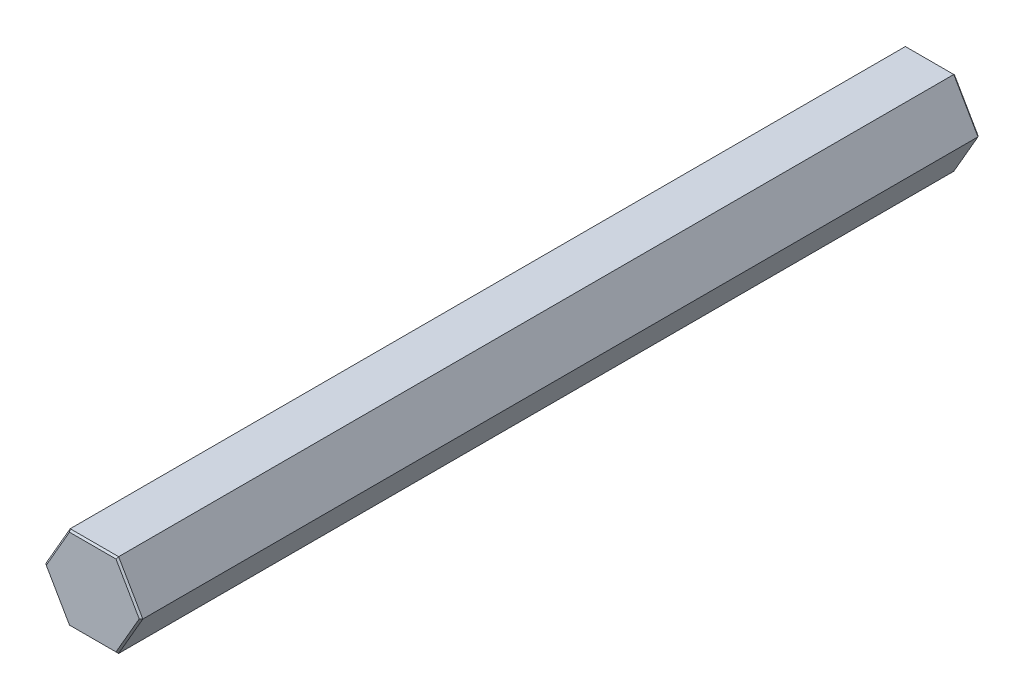
ISO-10303-21;
HEADER;
FILE_DESCRIPTION(('STEP AP214'),'2;1');
FILE_NAME('part.step','',(''),(''),'','','');
FILE_SCHEMA(('AUTOMOTIVE_DESIGN { 1 0 10303 214 1 1 1 1 }'));
ENDSEC;
DATA;
#1=APPLICATION_CONTEXT('core data for automotive mechanical design processes');
#2=APPLICATION_PROTOCOL_DEFINITION('international standard','automotive_design',2000,#1);
#3=PRODUCT_CONTEXT('',#1,'mechanical');
#4=PRODUCT('Part','Part','',(#3));
#5=PRODUCT_RELATED_PRODUCT_CATEGORY('part','',(#4));
#6=PRODUCT_DEFINITION_FORMATION('','',#4);
#7=PRODUCT_DEFINITION_CONTEXT('part definition',#1,'design');
#8=PRODUCT_DEFINITION('design','',#6,#7);
#9=PRODUCT_DEFINITION_SHAPE('','',#8);
#10=(LENGTH_UNIT() NAMED_UNIT(*) SI_UNIT(.MILLI.,.METRE.));
#11=(NAMED_UNIT(*) PLANE_ANGLE_UNIT() SI_UNIT($,.RADIAN.));
#12=(NAMED_UNIT(*) SI_UNIT($,.STERADIAN.) SOLID_ANGLE_UNIT());
#13=UNCERTAINTY_MEASURE_WITH_UNIT(LENGTH_MEASURE(1.E-05),#10,'distance_accuracy_value','');
#14=(GEOMETRIC_REPRESENTATION_CONTEXT(3) GLOBAL_UNCERTAINTY_ASSIGNED_CONTEXT((#13)) GLOBAL_UNIT_ASSIGNED_CONTEXT((#10,
#11,#12)) REPRESENTATION_CONTEXT('',''));
#15=CARTESIAN_POINT('',(0.,0.,0.));
#16=DIRECTION('',(0.,0.,1.));
#17=DIRECTION('',(1.,0.,0.));
#18=AXIS2_PLACEMENT_3D('',#15,#16,#17);
#19=CARTESIAN_POINT('',(7.11237796614698,-0.12700000000001,127.));
#20=DIRECTION('',(0.612372435695803,0.353553390593279,0.707106781186537));
#21=DIRECTION('',(0.755928946018445,0.,-0.654653670707988));
#22=AXIS2_PLACEMENT_3D('',#19,#20,#21);
#23=PLANE('',#22);
#24=DIRECTION('',(0.755928946018446,0.,-0.654653670707987));
#25=VECTOR('',#24,1.);
#26=CARTESIAN_POINT('',(7.08095361578108,0.,126.963714285714));
#27=LINE('',#26,#25);
#28=CARTESIAN_POINT('',(7.33234841870825,0.,126.746));
#29=VERTEX_POINT('',#28);
#30=CARTESIAN_POINT('',(7.03905448195989,0.,127.));
#31=VERTEX_POINT('',#30);
#32=EDGE_CURVE('E24',#29,#31,#27,.F.);
#33=ORIENTED_EDGE('',*,*,#32,.F.);
#34=DIRECTION('',(0.5,-0.866025403784438,0.));
#35=VECTOR('',#34,1.);
#36=CARTESIAN_POINT('',(7.33234841870825,0.,126.746));
#37=LINE('',#36,#35);
#38=CARTESIAN_POINT('',(3.66617420935412,6.35,126.746));
#39=VERTEX_POINT('',#38);
#40=EDGE_CURVE('E146',#29,#39,#37,.F.);
#41=ORIENTED_EDGE('',*,*,#40,.T.);
#42=DIRECTION('',(0.37796447300922,0.65465367070797,-0.654653670707988));
#43=VECTOR('',#42,1.);
#44=CARTESIAN_POINT('',(3.51952724097994,6.09599999999997,127.));
#45=LINE('',#44,#43);
#46=CARTESIAN_POINT('',(3.51952724097994,6.09599999999997,127.));
#47=VERTEX_POINT('',#46);
#48=EDGE_CURVE('E131',#47,#39,#45,.T.);
#49=ORIENTED_EDGE('',*,*,#48,.F.);
#50=DIRECTION('',(-0.5,0.866025403784438,0.));
#51=VECTOR('',#50,1.);
#52=CARTESIAN_POINT('',(7.03905448195989,0.,127.));
#53=LINE('',#52,#51);
#54=EDGE_CURVE('E108',#31,#47,#53,.T.);
#55=ORIENTED_EDGE('',*,*,#54,.F.);
#56=EDGE_LOOP('',(#33,#41,#49,#55));
#57=FACE_BOUND('',#56,.T.);
#58=ADVANCED_FACE('F21',(#57),#23,.T.);
#59=CARTESIAN_POINT('',(7.11237796614698,0.127000000000015,127.));
#60=DIRECTION('',(0.612372435695802,-0.353553390593278,0.707106781186538));
#61=DIRECTION('',(0.755928946018446,0.,-0.654653670707987));
#62=AXIS2_PLACEMENT_3D('',#59,#60,#61);
#63=PLANE('',#62);
#64=ORIENTED_EDGE('',*,*,#32,.T.);
#65=DIRECTION('',(0.5,0.866025403784439,0.));
#66=VECTOR('',#65,1.);
#67=CARTESIAN_POINT('',(3.51952724097995,-6.09599999999997,127.));
#68=LINE('',#67,#66);
#69=CARTESIAN_POINT('',(3.51952724097994,-6.09599999999997,127.));
#70=VERTEX_POINT('',#69);
#71=EDGE_CURVE('E117',#70,#31,#68,.T.);
#72=ORIENTED_EDGE('',*,*,#71,.F.);
#73=DIRECTION('',(-0.377964473009223,0.654653670707971,0.654653670707986));
#74=VECTOR('',#73,1.);
#75=CARTESIAN_POINT('',(3.66617420935412,-6.35,126.746));
#76=LINE('',#75,#74);
#77=CARTESIAN_POINT('',(3.66617420935412,-6.35,126.746));
#78=VERTEX_POINT('',#77);
#79=EDGE_CURVE('E138',#78,#70,#76,.T.);
#80=ORIENTED_EDGE('',*,*,#79,.F.);
#81=DIRECTION('',(-0.5,-0.866025403784439,0.));
#82=VECTOR('',#81,1.);
#83=CARTESIAN_POINT('',(3.66617420935413,-6.35,126.746));
#84=LINE('',#83,#82);
#85=EDGE_CURVE('E119',#78,#29,#84,.F.);
#86=ORIENTED_EDGE('',*,*,#85,.T.);
#87=EDGE_LOOP('',(#64,#72,#80,#86));
#88=FACE_BOUND('',#87,.T.);
#89=ADVANCED_FACE('F115',(#88),#63,.T.);
#90=CARTESIAN_POINT('',(3.66617420935413,-6.35,0.253999999999976));
#91=DIRECTION('',(-0.612372435695778,0.353553390593264,0.707106781186567));
#92=DIRECTION('',(0.755928946018472,0.,0.654653670707957));
#93=AXIS2_PLACEMENT_3D('',#90,#91,#92);
#94=PLANE('',#93);
#95=DIRECTION('',(0.5,0.866025403784439,0.));
#96=VECTOR('',#95,1.);
#97=CARTESIAN_POINT('',(3.51952724097997,-6.09600000000001,0.));
#98=LINE('',#97,#96);
#99=CARTESIAN_POINT('',(3.51952724097997,-6.09600000000001,0.));
#100=VERTEX_POINT('',#99);
#101=CARTESIAN_POINT('',(7.03905448195993,0.,0.));
#102=VERTEX_POINT('',#101);
#103=EDGE_CURVE('E175',#100,#102,#98,.T.);
#104=ORIENTED_EDGE('',*,*,#103,.T.);
#105=DIRECTION('',(0.755928946018471,0.,0.654653670707958));
#106=VECTOR('',#105,1.);
#107=CARTESIAN_POINT('',(7.33234841870825,0.,0.253999999999976));
#108=LINE('',#107,#106);
#109=CARTESIAN_POINT('',(7.33234841870825,0.,0.253999999999976));
#110=VERTEX_POINT('',#109);
#111=EDGE_CURVE('E124',#102,#110,#108,.T.);
#112=ORIENTED_EDGE('',*,*,#111,.T.);
#113=DIRECTION('',(-0.5,-0.866025403784439,0.));
#114=VECTOR('',#113,1.);
#115=CARTESIAN_POINT('',(3.66617420935413,-6.35,0.253999999999976));
#116=LINE('',#115,#114);
#117=CARTESIAN_POINT('',(3.66617420935413,-6.35,0.253999999999977));
#118=VERTEX_POINT('',#117);
#119=EDGE_CURVE('E190',#110,#118,#116,.T.);
#120=ORIENTED_EDGE('',*,*,#119,.T.);
#121=DIRECTION('',(-0.377964473009233,0.654653670707993,-0.654653670707958));
#122=VECTOR('',#121,1.);
#123=CARTESIAN_POINT('',(3.66617420935413,-6.35,0.253999999999976));
#124=LINE('',#123,#122);
#125=EDGE_CURVE('E208',#118,#100,#124,.T.);
#126=ORIENTED_EDGE('',*,*,#125,.T.);
#127=EDGE_LOOP('',(#104,#112,#120,#126));
#128=FACE_BOUND('',#127,.T.);
#129=ADVANCED_FACE('F188',(#128),#94,.F.);
#130=CARTESIAN_POINT('',(7.33234841870825,0.,0.253999999999976));
#131=DIRECTION('',(-0.612372435695778,-0.353553390593265,0.707106781186566));
#132=DIRECTION('',(0.755928946018471,0.,0.654653670707958));
#133=AXIS2_PLACEMENT_3D('',#130,#131,#132);
#134=PLANE('',#133);
#135=DIRECTION('',(-0.5,0.866025403784438,0.));
#136=VECTOR('',#135,1.);
#137=CARTESIAN_POINT('',(7.03905448195993,0.,0.));
#138=LINE('',#137,#136);
#139=CARTESIAN_POINT('',(3.51952724097996,6.09600000000001,0.));
#140=VERTEX_POINT('',#139);
#141=EDGE_CURVE('E170',#102,#140,#138,.T.);
#142=ORIENTED_EDGE('',*,*,#141,.T.);
#143=DIRECTION('',(0.377964473009235,0.654653670707992,0.654653670707958));
#144=VECTOR('',#143,1.);
#145=CARTESIAN_POINT('',(3.51952724097996,6.09600000000001,0.));
#146=LINE('',#145,#144);
#147=CARTESIAN_POINT('',(3.66617420935412,6.35,0.253999999999977));
#148=VERTEX_POINT('',#147);
#149=EDGE_CURVE('E183',#140,#148,#146,.T.);
#150=ORIENTED_EDGE('',*,*,#149,.T.);
#151=DIRECTION('',(0.5,-0.866025403784438,0.));
#152=VECTOR('',#151,1.);
#153=CARTESIAN_POINT('',(7.33234841870825,0.,0.253999999999976));
#154=LINE('',#153,#152);
#155=EDGE_CURVE('E129',#148,#110,#154,.T.);
#156=ORIENTED_EDGE('',*,*,#155,.T.);
#157=ORIENTED_EDGE('',*,*,#111,.F.);
#158=EDGE_LOOP('',(#142,#150,#156,#157));
#159=FACE_BOUND('',#158,.T.);
#160=ADVANCED_FACE('F196',(#159),#134,.F.);
#161=CARTESIAN_POINT('',(7.33234841870825,6.09599999999997,127.));
#162=DIRECTION('',(0.,0.707106781186557,0.707106781186538));
#163=DIRECTION('',(0.,-0.707106781186538,0.707106781186557));
#164=AXIS2_PLACEMENT_3D('',#161,#162,#163);
#165=PLANE('',#164);
#166=ORIENTED_EDGE('',*,*,#48,.T.);
#167=DIRECTION('',(1.,0.,0.));
#168=VECTOR('',#167,1.);
#169=CARTESIAN_POINT('',(3.66617420935412,6.35,126.746));
#170=LINE('',#169,#168);
#171=CARTESIAN_POINT('',(-3.66617420935412,6.35,126.746));
#172=VERTEX_POINT('',#171);
#173=EDGE_CURVE('E302',#39,#172,#170,.F.);
#174=ORIENTED_EDGE('',*,*,#173,.T.);
#175=DIRECTION('',(-0.377964473009222,0.65465367070797,-0.654653670707988));
#176=VECTOR('',#175,1.);
#177=CARTESIAN_POINT('',(-3.51952724097994,6.09599999999997,127.));
#178=LINE('',#177,#176);
#179=CARTESIAN_POINT('',(-3.51952724097994,6.09599999999997,127.));
#180=VERTEX_POINT('',#179);
#181=EDGE_CURVE('E163',#180,#172,#178,.T.);
#182=ORIENTED_EDGE('',*,*,#181,.F.);
#183=DIRECTION('',(1.,0.,0.));
#184=VECTOR('',#183,1.);
#185=CARTESIAN_POINT('',(7.33234841870825,6.09599999999997,127.));
#186=LINE('',#185,#184);
#187=EDGE_CURVE('E134',#47,#180,#186,.F.);
#188=ORIENTED_EDGE('',*,*,#187,.F.);
#189=EDGE_LOOP('',(#166,#174,#182,#188));
#190=FACE_BOUND('',#189,.T.);
#191=ADVANCED_FACE('F303',(#190),#165,.T.);
#192=CARTESIAN_POINT('',(3.66617420935412,6.35,0.253999999999976));
#193=DIRECTION('',(0.,-0.707106781186529,0.707106781186566));
#194=DIRECTION('',(0.,-0.707106781186566,-0.707106781186529));
#195=AXIS2_PLACEMENT_3D('',#192,#193,#194);
#196=PLANE('',#195);
#197=DIRECTION('',(1.,0.,0.));
#198=VECTOR('',#197,1.);
#199=CARTESIAN_POINT('',(3.66617420935412,6.35,0.253999999999976));
#200=LINE('',#199,#198);
#201=CARTESIAN_POINT('',(-3.66617420935412,6.35,0.253999999999976));
#202=VERTEX_POINT('',#201);
#203=EDGE_CURVE('E306',#202,#148,#200,.T.);
#204=ORIENTED_EDGE('',*,*,#203,.T.);
#205=ORIENTED_EDGE('',*,*,#149,.F.);
#206=DIRECTION('',(1.,0.,0.));
#207=VECTOR('',#206,1.);
#208=CARTESIAN_POINT('',(7.33234841870825,6.09600000000001,0.));
#209=LINE('',#208,#207);
#210=CARTESIAN_POINT('',(-3.51952724097996,6.09600000000001,0.));
#211=VERTEX_POINT('',#210);
#212=EDGE_CURVE('E167',#140,#211,#209,.F.);
#213=ORIENTED_EDGE('',*,*,#212,.T.);
#214=DIRECTION('',(-0.377964473009238,0.654653670707991,0.654653670707957));
#215=VECTOR('',#214,1.);
#216=CARTESIAN_POINT('',(-3.51952724097996,6.09600000000001,0.));
#217=LINE('',#216,#215);
#218=EDGE_CURVE('E307',#211,#202,#217,.T.);
#219=ORIENTED_EDGE('',*,*,#218,.T.);
#220=EDGE_LOOP('',(#204,#205,#213,#219));
#221=FACE_BOUND('',#220,.T.);
#222=ADVANCED_FACE('F316',(#221),#196,.F.);
#223=CARTESIAN_POINT('',(7.33234841870825,0.,127.));
#224=DIRECTION('',(-0.866025403784438,-0.5,0.));
#225=DIRECTION('',(0.5,-0.866025403784438,0.));
#226=AXIS2_PLACEMENT_3D('',#223,#224,#225);
#227=PLANE('',#226);
#228=ORIENTED_EDGE('',*,*,#155,.F.);
#229=DIRECTION('',(0.,0.,-1.));
#230=VECTOR('',#229,1.);
#231=CARTESIAN_POINT('',(3.66617420935412,6.35,127.));
#232=LINE('',#231,#230);
#233=EDGE_CURVE('E312',#148,#39,#232,.F.);
#234=ORIENTED_EDGE('',*,*,#233,.T.);
#235=ORIENTED_EDGE('',*,*,#40,.F.);
#236=DIRECTION('',(0.,0.,1.));
#237=VECTOR('',#236,1.);
#238=CARTESIAN_POINT('',(7.33234841870825,0.,127.));
#239=LINE('',#238,#237);
#240=EDGE_CURVE('E204',#29,#110,#239,.F.);
#241=ORIENTED_EDGE('',*,*,#240,.T.);
#242=EDGE_LOOP('',(#228,#234,#235,#241));
#243=FACE_BOUND('',#242,.T.);
#244=ADVANCED_FACE('F210',(#243),#227,.F.);
#245=CARTESIAN_POINT('',(7.33234841870825,0.,127.));
#246=DIRECTION('',(0.,0.,1.));
#247=DIRECTION('',(1.,0.,0.));
#248=AXIS2_PLACEMENT_3D('',#245,#246,#247);
#249=PLANE('',#248);
#250=DIRECTION('',(0.5,0.866025403784438,0.));
#251=VECTOR('',#250,1.);
#252=CARTESIAN_POINT('',(-7.03905448195989,0.,127.));
#253=LINE('',#252,#251);
#254=CARTESIAN_POINT('',(-7.03905448195988,0.,127.));
#255=VERTEX_POINT('',#254);
#256=EDGE_CURVE('E156',#255,#180,#253,.T.);
#257=ORIENTED_EDGE('',*,*,#256,.F.);
#258=DIRECTION('',(-0.5,0.866025403784439,0.));
#259=VECTOR('',#258,1.);
#260=CARTESIAN_POINT('',(-3.51952724097994,-6.09599999999997,127.));
#261=LINE('',#260,#259);
#262=CARTESIAN_POINT('',(-3.51952724097994,-6.09599999999997,127.));
#263=VERTEX_POINT('',#262);
#264=EDGE_CURVE('E238',#263,#255,#261,.T.);
#265=ORIENTED_EDGE('',*,*,#264,.F.);
#266=DIRECTION('',(1.,0.,0.));
#267=VECTOR('',#266,1.);
#268=CARTESIAN_POINT('',(7.33234841870825,-6.09599999999997,127.));
#269=LINE('',#268,#267);
#270=EDGE_CURVE('E127',#70,#263,#269,.F.);
#271=ORIENTED_EDGE('',*,*,#270,.F.);
#272=ORIENTED_EDGE('',*,*,#71,.T.);
#273=ORIENTED_EDGE('',*,*,#54,.T.);
#274=ORIENTED_EDGE('',*,*,#187,.T.);
#275=EDGE_LOOP('',(#257,#265,#271,#272,#273,#274));
#276=FACE_BOUND('',#275,.T.);
#277=ADVANCED_FACE('F125',(#276),#249,.T.);
#278=CARTESIAN_POINT('',(7.33234841870825,-6.09599999999997,127.));
#279=DIRECTION('',(0.,-0.707106781186557,0.707106781186538));
#280=DIRECTION('',(0.,-0.707106781186538,-0.707106781186557));
#281=AXIS2_PLACEMENT_3D('',#278,#279,#280);
#282=PLANE('',#281);
#283=ORIENTED_EDGE('',*,*,#79,.T.);
#284=ORIENTED_EDGE('',*,*,#270,.T.);
#285=DIRECTION('',(0.37796447300922,0.65465367070797,0.654653670707988));
#286=VECTOR('',#285,1.);
#287=CARTESIAN_POINT('',(-3.66617420935412,-6.35,126.746));
#288=LINE('',#287,#286);
#289=CARTESIAN_POINT('',(-3.66617420935412,-6.35,126.746));
#290=VERTEX_POINT('',#289);
#291=EDGE_CURVE('E246',#290,#263,#288,.T.);
#292=ORIENTED_EDGE('',*,*,#291,.F.);
#293=DIRECTION('',(-1.,0.,0.));
#294=VECTOR('',#293,1.);
#295=CARTESIAN_POINT('',(-3.66617420935412,-6.35,126.746));
#296=LINE('',#295,#294);
#297=EDGE_CURVE('E226',#290,#78,#296,.F.);
#298=ORIENTED_EDGE('',*,*,#297,.T.);
#299=EDGE_LOOP('',(#283,#284,#292,#298));
#300=FACE_BOUND('',#299,.T.);
#301=ADVANCED_FACE('F223',(#300),#282,.T.);
#302=CARTESIAN_POINT('',(3.66617420935413,-6.35,127.));
#303=DIRECTION('',(-0.866025403784439,0.5,0.));
#304=DIRECTION('',(-0.5,-0.866025403784439,0.));
#305=AXIS2_PLACEMENT_3D('',#302,#303,#304);
#306=PLANE('',#305);
#307=ORIENTED_EDGE('',*,*,#119,.F.);
#308=ORIENTED_EDGE('',*,*,#240,.F.);
#309=ORIENTED_EDGE('',*,*,#85,.F.);
#310=DIRECTION('',(0.,0.,1.));
#311=VECTOR('',#310,1.);
#312=CARTESIAN_POINT('',(3.66617420935413,-6.35,127.));
#313=LINE('',#312,#311);
#314=EDGE_CURVE('E206',#78,#118,#313,.F.);
#315=ORIENTED_EDGE('',*,*,#314,.T.);
#316=EDGE_LOOP('',(#307,#308,#309,#315));
#317=FACE_BOUND('',#316,.T.);
#318=ADVANCED_FACE('F203',(#317),#306,.F.);
#319=CARTESIAN_POINT('',(-3.66617420935412,-6.35,0.253999999999976));
#320=DIRECTION('',(0.,0.707106781186528,0.707106781186568));
#321=DIRECTION('',(0.,-0.707106781186568,0.707106781186528));
#322=AXIS2_PLACEMENT_3D('',#319,#320,#321);
#323=PLANE('',#322);
#324=DIRECTION('',(1.,0.,0.));
#325=VECTOR('',#324,1.);
#326=CARTESIAN_POINT('',(7.33234841870825,-6.09600000000001,0.));
#327=LINE('',#326,#325);
#328=CARTESIAN_POINT('',(-3.51952724097996,-6.09600000000001,0.));
#329=VERTEX_POINT('',#328);
#330=EDGE_CURVE('E527',#329,#100,#327,.T.);
#331=ORIENTED_EDGE('',*,*,#330,.T.);
#332=ORIENTED_EDGE('',*,*,#125,.F.);
#333=DIRECTION('',(-1.,0.,0.));
#334=VECTOR('',#333,1.);
#335=CARTESIAN_POINT('',(-3.66617420935412,-6.35,0.253999999999976));
#336=LINE('',#335,#334);
#337=CARTESIAN_POINT('',(-3.66617420935412,-6.35,0.253999999999973));
#338=VERTEX_POINT('',#337);
#339=EDGE_CURVE('E231',#118,#338,#336,.T.);
#340=ORIENTED_EDGE('',*,*,#339,.T.);
#341=DIRECTION('',(-0.377964473009231,-0.654653670707995,0.654653670707957));
#342=VECTOR('',#341,1.);
#343=CARTESIAN_POINT('',(-3.51952724097996,-6.09600000000001,0.));
#344=LINE('',#343,#342);
#345=EDGE_CURVE('E288',#329,#338,#344,.T.);
#346=ORIENTED_EDGE('',*,*,#345,.F.);
#347=EDGE_LOOP('',(#331,#332,#340,#346));
#348=FACE_BOUND('',#347,.T.);
#349=ADVANCED_FACE('F338',(#348),#323,.F.);
#350=CARTESIAN_POINT('',(7.33234841870825,0.,0.));
#351=DIRECTION('',(0.,0.,1.));
#352=DIRECTION('',(1.,0.,0.));
#353=AXIS2_PLACEMENT_3D('',#350,#351,#352);
#354=PLANE('',#353);
#355=ORIENTED_EDGE('',*,*,#141,.F.);
#356=ORIENTED_EDGE('',*,*,#103,.F.);
#357=ORIENTED_EDGE('',*,*,#330,.F.);
#358=DIRECTION('',(-0.5,0.866025403784438,0.));
#359=VECTOR('',#358,1.);
#360=CARTESIAN_POINT('',(-3.51952724097996,-6.09600000000001,0.));
#361=LINE('',#360,#359);
#362=CARTESIAN_POINT('',(-7.03905448195993,0.,0.));
#363=VERTEX_POINT('',#362);
#364=EDGE_CURVE('E236',#329,#363,#361,.T.);
#365=ORIENTED_EDGE('',*,*,#364,.T.);
#366=DIRECTION('',(0.5,0.866025403784439,0.));
#367=VECTOR('',#366,1.);
#368=CARTESIAN_POINT('',(-7.03905448195992,0.,0.));
#369=LINE('',#368,#367);
#370=EDGE_CURVE('E162',#363,#211,#369,.T.);
#371=ORIENTED_EDGE('',*,*,#370,.T.);
#372=ORIENTED_EDGE('',*,*,#212,.F.);
#373=EDGE_LOOP('',(#355,#356,#357,#365,#371,#372));
#374=FACE_BOUND('',#373,.T.);
#375=ADVANCED_FACE('F330',(#374),#354,.F.);
#376=CARTESIAN_POINT('',(-3.44620375679285,6.22299999999999,127.));
#377=DIRECTION('',(-0.612372435695803,0.353553390593279,0.707106781186537));
#378=DIRECTION('',(0.755928946018445,0.,0.654653670707988));
#379=AXIS2_PLACEMENT_3D('',#376,#377,#378);
#380=PLANE('',#379);
#381=DIRECTION('',(0.755928946018445,0.,0.654653670707989));
#382=VECTOR('',#381,1.);
#383=CARTESIAN_POINT('',(-4.98599692472163,0.,128.778));
#384=LINE('',#383,#382);
#385=CARTESIAN_POINT('',(-7.33234841870824,0.,126.746));
#386=VERTEX_POINT('',#385);
#387=EDGE_CURVE('E250',#255,#386,#384,.F.);
#388=ORIENTED_EDGE('',*,*,#387,.F.);
#389=ORIENTED_EDGE('',*,*,#256,.T.);
#390=ORIENTED_EDGE('',*,*,#181,.T.);
#391=DIRECTION('',(0.5,0.866025403784439,0.));
#392=VECTOR('',#391,1.);
#393=CARTESIAN_POINT('',(-3.66617420935412,6.35,126.746));
#394=LINE('',#393,#392);
#395=EDGE_CURVE('E264',#172,#386,#394,.F.);
#396=ORIENTED_EDGE('',*,*,#395,.T.);
#397=EDGE_LOOP('',(#388,#389,#390,#396));
#398=FACE_BOUND('',#397,.T.);
#399=ADVANCED_FACE('F327',(#398),#380,.T.);
#400=CARTESIAN_POINT('',(-3.66617420935412,6.35,0.253999999999976));
#401=DIRECTION('',(0.612372435695778,-0.353553390593264,0.707106781186567));
#402=DIRECTION('',(0.755928946018472,0.,-0.654653670707957));
#403=AXIS2_PLACEMENT_3D('',#400,#401,#402);
#404=PLANE('',#403);
#405=DIRECTION('',(0.5,0.866025403784439,0.));
#406=VECTOR('',#405,1.);
#407=CARTESIAN_POINT('',(-3.66617420935412,6.35,0.253999999999976));
#408=LINE('',#407,#406);
#409=CARTESIAN_POINT('',(-7.33234841870824,0.,0.253999999999966));
#410=VERTEX_POINT('',#409);
#411=EDGE_CURVE('E39',#410,#202,#408,.T.);
#412=ORIENTED_EDGE('',*,*,#411,.T.);
#413=ORIENTED_EDGE('',*,*,#218,.F.);
#414=ORIENTED_EDGE('',*,*,#370,.F.);
#415=DIRECTION('',(0.755928946018471,0.,-0.654653670707957));
#416=VECTOR('',#415,1.);
#417=CARTESIAN_POINT('',(-7.33234841870824,0.,0.253999999999977));
#418=LINE('',#417,#416);
#419=EDGE_CURVE('E261',#363,#410,#418,.F.);
#420=ORIENTED_EDGE('',*,*,#419,.T.);
#421=EDGE_LOOP('',(#412,#413,#414,#420));
#422=FACE_BOUND('',#421,.T.);
#423=ADVANCED_FACE('F329',(#422),#404,.F.);
#424=CARTESIAN_POINT('',(3.66617420935412,6.35,127.));
#425=DIRECTION('',(0.,-1.,0.));
#426=DIRECTION('',(0.,0.,-1.));
#427=AXIS2_PLACEMENT_3D('',#424,#425,#426);
#428=PLANE('',#427);
#429=ORIENTED_EDGE('',*,*,#203,.F.);
#430=DIRECTION('',(0.,0.,1.));
#431=VECTOR('',#430,1.);
#432=CARTESIAN_POINT('',(-3.66617420935412,6.35,127.));
#433=LINE('',#432,#431);
#434=EDGE_CURVE('E270',#202,#172,#433,.T.);
#435=ORIENTED_EDGE('',*,*,#434,.T.);
#436=ORIENTED_EDGE('',*,*,#173,.F.);
#437=ORIENTED_EDGE('',*,*,#233,.F.);
#438=EDGE_LOOP('',(#429,#435,#436,#437));
#439=FACE_BOUND('',#438,.T.);
#440=ADVANCED_FACE('F309',(#439),#428,.F.);
#441=CARTESIAN_POINT('',(-3.44620375679285,-6.22299999999999,127.));
#442=DIRECTION('',(-0.612372435695804,-0.353553390593279,0.707106781186537));
#443=DIRECTION('',(0.755928946018445,0.,0.654653670707989));
#444=AXIS2_PLACEMENT_3D('',#441,#442,#443);
#445=PLANE('',#444);
#446=ORIENTED_EDGE('',*,*,#291,.T.);
#447=ORIENTED_EDGE('',*,*,#264,.T.);
#448=ORIENTED_EDGE('',*,*,#387,.T.);
#449=DIRECTION('',(-0.5,0.866025403784439,0.));
#450=VECTOR('',#449,1.);
#451=CARTESIAN_POINT('',(-7.33234841870824,0.,126.746));
#452=LINE('',#451,#450);
#453=EDGE_CURVE('E274',#386,#290,#452,.F.);
#454=ORIENTED_EDGE('',*,*,#453,.T.);
#455=EDGE_LOOP('',(#446,#447,#448,#454));
#456=FACE_BOUND('',#455,.T.);
#457=ADVANCED_FACE('F326',(#456),#445,.T.);
#458=CARTESIAN_POINT('',(-3.66617420935412,-6.35,127.));
#459=DIRECTION('',(0.,1.,0.));
#460=DIRECTION('',(-1.,0.,0.));
#461=AXIS2_PLACEMENT_3D('',#458,#459,#460);
#462=PLANE('',#461);
#463=ORIENTED_EDGE('',*,*,#339,.F.);
#464=ORIENTED_EDGE('',*,*,#314,.F.);
#465=ORIENTED_EDGE('',*,*,#297,.F.);
#466=DIRECTION('',(0.,0.,1.));
#467=VECTOR('',#466,1.);
#468=CARTESIAN_POINT('',(-3.66617420935412,-6.35,127.));
#469=LINE('',#468,#467);
#470=EDGE_CURVE('E278',#290,#338,#469,.F.);
#471=ORIENTED_EDGE('',*,*,#470,.T.);
#472=EDGE_LOOP('',(#463,#464,#465,#471));
#473=FACE_BOUND('',#472,.T.);
#474=ADVANCED_FACE('F228',(#473),#462,.F.);
#475=CARTESIAN_POINT('',(-7.33234841870824,0.,0.253999999999976));
#476=DIRECTION('',(0.612372435695778,0.353553390593265,0.707106781186566));
#477=DIRECTION('',(0.755928946018471,0.,-0.654653670707957));
#478=AXIS2_PLACEMENT_3D('',#475,#476,#477);
#479=PLANE('',#478);
#480=ORIENTED_EDGE('',*,*,#364,.F.);
#481=ORIENTED_EDGE('',*,*,#345,.T.);
#482=DIRECTION('',(-0.5,0.866025403784439,0.));
#483=VECTOR('',#482,1.);
#484=CARTESIAN_POINT('',(-7.33234841870824,0.,0.253999999999921));
#485=LINE('',#484,#483);
#486=EDGE_CURVE('E31',#338,#410,#485,.T.);
#487=ORIENTED_EDGE('',*,*,#486,.T.);
#488=ORIENTED_EDGE('',*,*,#419,.F.);
#489=EDGE_LOOP('',(#480,#481,#487,#488));
#490=FACE_BOUND('',#489,.T.);
#491=ADVANCED_FACE('F287',(#490),#479,.F.);
#492=CARTESIAN_POINT('',(-3.66617420935412,6.35,127.));
#493=DIRECTION('',(0.866025403784439,-0.5,0.));
#494=DIRECTION('',(0.5,0.866025403784439,0.));
#495=AXIS2_PLACEMENT_3D('',#492,#493,#494);
#496=PLANE('',#495);
#497=ORIENTED_EDGE('',*,*,#411,.F.);
#498=DIRECTION('',(0.,0.,1.));
#499=VECTOR('',#498,1.);
#500=CARTESIAN_POINT('',(-7.33234841870824,0.,127.));
#501=LINE('',#500,#499);
#502=EDGE_CURVE('E12',#410,#386,#501,.T.);
#503=ORIENTED_EDGE('',*,*,#502,.T.);
#504=ORIENTED_EDGE('',*,*,#395,.F.);
#505=ORIENTED_EDGE('',*,*,#434,.F.);
#506=EDGE_LOOP('',(#497,#503,#504,#505));
#507=FACE_BOUND('',#506,.T.);
#508=ADVANCED_FACE('F295',(#507),#496,.F.);
#509=CARTESIAN_POINT('',(-7.33234841870824,0.,127.));
#510=DIRECTION('',(0.866025403784439,0.5,0.));
#511=DIRECTION('',(-0.5,0.866025403784439,0.));
#512=AXIS2_PLACEMENT_3D('',#509,#510,#511);
#513=PLANE('',#512);
#514=ORIENTED_EDGE('',*,*,#486,.F.);
#515=ORIENTED_EDGE('',*,*,#470,.F.);
#516=ORIENTED_EDGE('',*,*,#453,.F.);
#517=ORIENTED_EDGE('',*,*,#502,.F.);
#518=EDGE_LOOP('',(#514,#515,#516,#517));
#519=FACE_BOUND('',#518,.T.);
#520=ADVANCED_FACE('F292',(#519),#513,.F.);
#521=CLOSED_SHELL('',(#58,#89,#129,#160,#191,#222,#244,#277,#301,#318,#349,#375,#399,#423,#440,
#457,#474,#491,#508,#520));
#522=MANIFOLD_SOLID_BREP('B1',#521);
#523=ADVANCED_BREP_SHAPE_REPRESENTATION('',(#18,#522),#14);
#524=SHAPE_DEFINITION_REPRESENTATION(#9,#523);
ENDSEC;
END-ISO-10303-21;
